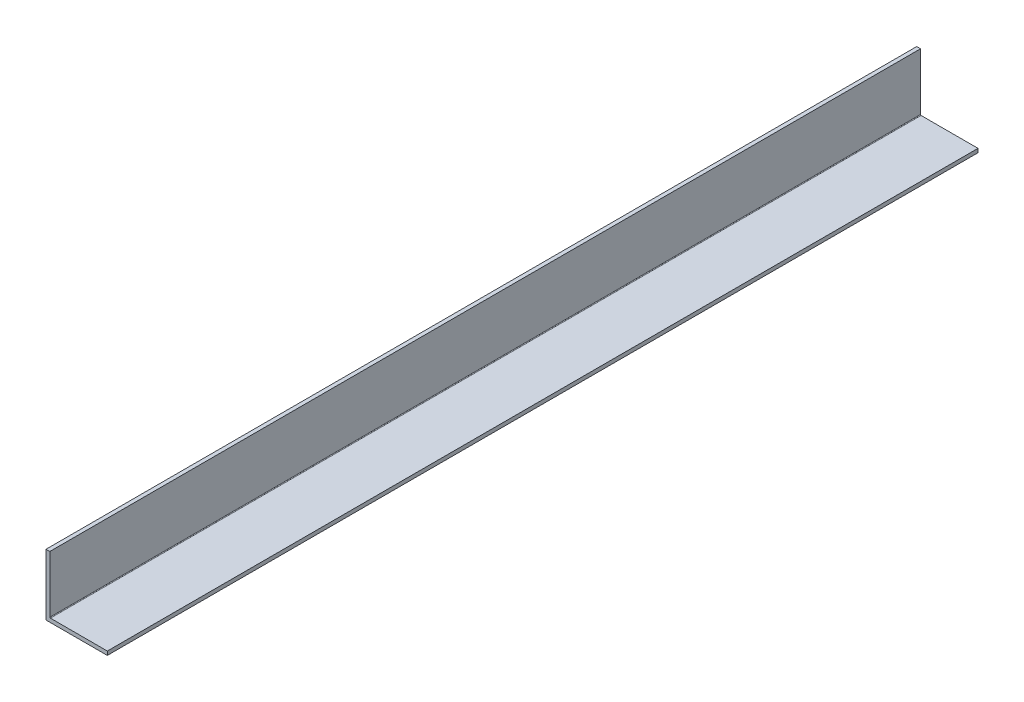
ISO-10303-21;
HEADER;
FILE_DESCRIPTION(('STEP AP214'),'2;1');
FILE_NAME('part.step','',(''),(''),'','','');
FILE_SCHEMA(('AUTOMOTIVE_DESIGN { 1 0 10303 214 1 1 1 1 }'));
ENDSEC;
DATA;
#1=APPLICATION_CONTEXT('core data for automotive mechanical design processes');
#2=APPLICATION_PROTOCOL_DEFINITION('international standard','automotive_design',2000,#1);
#3=PRODUCT_CONTEXT('',#1,'mechanical');
#4=PRODUCT('Part','Part','',(#3));
#5=PRODUCT_RELATED_PRODUCT_CATEGORY('part','',(#4));
#6=PRODUCT_DEFINITION_FORMATION('','',#4);
#7=PRODUCT_DEFINITION_CONTEXT('part definition',#1,'design');
#8=PRODUCT_DEFINITION('design','',#6,#7);
#9=PRODUCT_DEFINITION_SHAPE('','',#8);
#10=(LENGTH_UNIT() NAMED_UNIT(*) SI_UNIT(.MILLI.,.METRE.));
#11=(NAMED_UNIT(*) PLANE_ANGLE_UNIT() SI_UNIT($,.RADIAN.));
#12=(NAMED_UNIT(*) SI_UNIT($,.STERADIAN.) SOLID_ANGLE_UNIT());
#13=UNCERTAINTY_MEASURE_WITH_UNIT(LENGTH_MEASURE(1.E-05),#10,'distance_accuracy_value','');
#14=(GEOMETRIC_REPRESENTATION_CONTEXT(3) GLOBAL_UNCERTAINTY_ASSIGNED_CONTEXT((#13)) GLOBAL_UNIT_ASSIGNED_CONTEXT((#10,
#11,#12)) REPRESENTATION_CONTEXT('',''));
#15=CARTESIAN_POINT('',(0.,0.,0.));
#16=DIRECTION('',(0.,0.,1.));
#17=DIRECTION('',(1.,0.,0.));
#18=AXIS2_PLACEMENT_3D('',#15,#16,#17);
#19=CARTESIAN_POINT('',(1.5875,1.5875,304.8));
#20=DIRECTION('',(-1.,0.,0.));
#21=DIRECTION('',(0.,0.,1.));
#22=AXIS2_PLACEMENT_3D('',#19,#20,#21);
#23=PLANE('',#22);
#24=DIRECTION('',(0.,0.,-1.));
#25=VECTOR('',#24,1.);
#26=CARTESIAN_POINT('',(1.5875,1.8415,-304.8));
#27=LINE('',#26,#25);
#28=CARTESIAN_POINT('',(1.5875,1.8415,304.8));
#29=VERTEX_POINT('',#28);
#30=CARTESIAN_POINT('',(1.5875,1.8415,-55.8625));
#31=VERTEX_POINT('',#30);
#32=EDGE_CURVE('E133',#29,#31,#27,.T.);
#33=ORIENTED_EDGE('',*,*,#32,.T.);
#34=DIRECTION('',(0.,-1.,0.));
#35=VECTOR('',#34,1.);
#36=CARTESIAN_POINT('',(1.5875,25.4,-55.8625));
#37=LINE('',#36,#35);
#38=CARTESIAN_POINT('',(1.5875,25.4,-55.8625));
#39=VERTEX_POINT('',#38);
#40=EDGE_CURVE('E60',#39,#31,#37,.T.);
#41=ORIENTED_EDGE('',*,*,#40,.F.);
#42=DIRECTION('',(0.,0.,-1.));
#43=VECTOR('',#42,1.);
#44=CARTESIAN_POINT('',(1.5875,25.4,304.8));
#45=LINE('',#44,#43);
#46=CARTESIAN_POINT('',(1.5875,25.4,304.8));
#47=VERTEX_POINT('',#46);
#48=EDGE_CURVE('E122',#47,#39,#45,.T.);
#49=ORIENTED_EDGE('',*,*,#48,.F.);
#50=DIRECTION('',(0.,1.,0.));
#51=VECTOR('',#50,1.);
#52=CARTESIAN_POINT('',(1.5875,1.5875,304.8));
#53=LINE('',#52,#51);
#54=EDGE_CURVE('E124',#29,#47,#53,.T.);
#55=ORIENTED_EDGE('',*,*,#54,.F.);
#56=EDGE_LOOP('',(#33,#41,#49,#55));
#57=FACE_BOUND('',#56,.T.);
#58=ADVANCED_FACE('F44',(#57),#23,.F.);
#59=CARTESIAN_POINT('',(1.5875,25.4,304.8));
#60=DIRECTION('',(0.,-1.,0.));
#61=DIRECTION('',(0.,0.,-1.));
#62=AXIS2_PLACEMENT_3D('',#59,#60,#61);
#63=PLANE('',#62);
#64=ORIENTED_EDGE('',*,*,#48,.T.);
#65=DIRECTION('',(1.,0.,0.));
#66=VECTOR('',#65,1.);
#67=CARTESIAN_POINT('',(0.,25.4,-55.8625));
#68=LINE('',#67,#66);
#69=CARTESIAN_POINT('',(0.,25.4,-55.8625));
#70=VERTEX_POINT('',#69);
#71=EDGE_CURVE('E105',#70,#39,#68,.T.);
#72=ORIENTED_EDGE('',*,*,#71,.F.);
#73=DIRECTION('',(0.,0.,-1.));
#74=VECTOR('',#73,1.);
#75=CARTESIAN_POINT('',(0.,25.4,304.8));
#76=LINE('',#75,#74);
#77=CARTESIAN_POINT('',(0.,25.4,304.8));
#78=VERTEX_POINT('',#77);
#79=EDGE_CURVE('E119',#78,#70,#76,.T.);
#80=ORIENTED_EDGE('',*,*,#79,.F.);
#81=DIRECTION('',(-1.,0.,0.));
#82=VECTOR('',#81,1.);
#83=CARTESIAN_POINT('',(1.5875,25.4,304.8));
#84=LINE('',#83,#82);
#85=EDGE_CURVE('E160',#47,#78,#84,.T.);
#86=ORIENTED_EDGE('',*,*,#85,.F.);
#87=EDGE_LOOP('',(#64,#72,#80,#86));
#88=FACE_BOUND('',#87,.T.);
#89=ADVANCED_FACE('F117',(#88),#63,.F.);
#90=CARTESIAN_POINT('',(0.,25.4,304.8));
#91=DIRECTION('',(1.,0.,0.));
#92=DIRECTION('',(0.,1.,0.));
#93=AXIS2_PLACEMENT_3D('',#90,#91,#92);
#94=PLANE('',#93);
#95=ORIENTED_EDGE('',*,*,#79,.T.);
#96=DIRECTION('',(0.,1.,0.));
#97=VECTOR('',#96,1.);
#98=CARTESIAN_POINT('',(0.,0.,-55.8625));
#99=LINE('',#98,#97);
#100=CARTESIAN_POINT('',(0.,0.,-55.8625));
#101=VERTEX_POINT('',#100);
#102=EDGE_CURVE('E102',#101,#70,#99,.T.);
#103=ORIENTED_EDGE('',*,*,#102,.F.);
#104=DIRECTION('',(0.,0.,-1.));
#105=VECTOR('',#104,1.);
#106=CARTESIAN_POINT('',(0.,0.,304.8));
#107=LINE('',#106,#105);
#108=CARTESIAN_POINT('',(0.,0.,304.8));
#109=VERTEX_POINT('',#108);
#110=EDGE_CURVE('E129',#109,#101,#107,.T.);
#111=ORIENTED_EDGE('',*,*,#110,.F.);
#112=DIRECTION('',(0.,-1.,0.));
#113=VECTOR('',#112,1.);
#114=CARTESIAN_POINT('',(0.,25.4,304.8));
#115=LINE('',#114,#113);
#116=EDGE_CURVE('E127',#78,#109,#115,.T.);
#117=ORIENTED_EDGE('',*,*,#116,.F.);
#118=EDGE_LOOP('',(#95,#103,#111,#117));
#119=FACE_BOUND('',#118,.T.);
#120=ADVANCED_FACE('F126',(#119),#94,.F.);
#121=CARTESIAN_POINT('',(0.,0.,304.8));
#122=DIRECTION('',(0.,1.,0.));
#123=DIRECTION('',(0.,0.,1.));
#124=AXIS2_PLACEMENT_3D('',#121,#122,#123);
#125=PLANE('',#124);
#126=ORIENTED_EDGE('',*,*,#110,.T.);
#127=DIRECTION('',(-1.,0.,0.));
#128=VECTOR('',#127,1.);
#129=CARTESIAN_POINT('',(25.4,0.,-55.8625));
#130=LINE('',#129,#128);
#131=CARTESIAN_POINT('',(25.4,0.,-55.8625));
#132=VERTEX_POINT('',#131);
#133=EDGE_CURVE('E107',#132,#101,#130,.T.);
#134=ORIENTED_EDGE('',*,*,#133,.F.);
#135=DIRECTION('',(0.,0.,-1.));
#136=VECTOR('',#135,1.);
#137=CARTESIAN_POINT('',(25.4,0.,304.8));
#138=LINE('',#137,#136);
#139=CARTESIAN_POINT('',(25.4,0.,304.8));
#140=VERTEX_POINT('',#139);
#141=EDGE_CURVE('E135',#140,#132,#138,.T.);
#142=ORIENTED_EDGE('',*,*,#141,.F.);
#143=DIRECTION('',(1.,0.,0.));
#144=VECTOR('',#143,1.);
#145=CARTESIAN_POINT('',(0.,0.,304.8));
#146=LINE('',#145,#144);
#147=EDGE_CURVE('E165',#109,#140,#146,.T.);
#148=ORIENTED_EDGE('',*,*,#147,.F.);
#149=EDGE_LOOP('',(#126,#134,#142,#148));
#150=FACE_BOUND('',#149,.T.);
#151=ADVANCED_FACE('F187',(#150),#125,.F.);
#152=CARTESIAN_POINT('',(25.4,0.,304.8));
#153=DIRECTION('',(-1.,0.,0.));
#154=DIRECTION('',(0.,0.,1.));
#155=AXIS2_PLACEMENT_3D('',#152,#153,#154);
#156=PLANE('',#155);
#157=ORIENTED_EDGE('',*,*,#141,.T.);
#158=DIRECTION('',(0.,-1.,0.));
#159=VECTOR('',#158,1.);
#160=CARTESIAN_POINT('',(25.4,1.5875,-55.8625));
#161=LINE('',#160,#159);
#162=CARTESIAN_POINT('',(25.4,1.5875,-55.8625));
#163=VERTEX_POINT('',#162);
#164=EDGE_CURVE('E153',#163,#132,#161,.T.);
#165=ORIENTED_EDGE('',*,*,#164,.F.);
#166=DIRECTION('',(0.,0.,-1.));
#167=VECTOR('',#166,1.);
#168=CARTESIAN_POINT('',(25.4,1.5875,304.8));
#169=LINE('',#168,#167);
#170=CARTESIAN_POINT('',(25.4,1.5875,304.8));
#171=VERTEX_POINT('',#170);
#172=EDGE_CURVE('E174',#171,#163,#169,.T.);
#173=ORIENTED_EDGE('',*,*,#172,.F.);
#174=DIRECTION('',(0.,1.,0.));
#175=VECTOR('',#174,1.);
#176=CARTESIAN_POINT('',(25.4,0.,304.8));
#177=LINE('',#176,#175);
#178=EDGE_CURVE('E168',#140,#171,#177,.T.);
#179=ORIENTED_EDGE('',*,*,#178,.F.);
#180=EDGE_LOOP('',(#157,#165,#173,#179));
#181=FACE_BOUND('',#180,.T.);
#182=ADVANCED_FACE('F183',(#181),#156,.F.);
#183=CARTESIAN_POINT('',(25.4,1.5875,304.8));
#184=DIRECTION('',(0.,-1.,0.));
#185=DIRECTION('',(1.,0.,0.));
#186=AXIS2_PLACEMENT_3D('',#183,#184,#185);
#187=PLANE('',#186);
#188=ORIENTED_EDGE('',*,*,#172,.T.);
#189=DIRECTION('',(1.,0.,0.));
#190=VECTOR('',#189,1.);
#191=CARTESIAN_POINT('',(1.8415,1.5875,-55.8625));
#192=LINE('',#191,#190);
#193=CARTESIAN_POINT('',(1.8415,1.5875,-55.8625));
#194=VERTEX_POINT('',#193);
#195=EDGE_CURVE('E149',#194,#163,#192,.T.);
#196=ORIENTED_EDGE('',*,*,#195,.F.);
#197=DIRECTION('',(0.,0.,-1.));
#198=VECTOR('',#197,1.);
#199=CARTESIAN_POINT('',(1.8415,1.5875,304.8));
#200=LINE('',#199,#198);
#201=CARTESIAN_POINT('',(1.8415,1.5875,304.8));
#202=VERTEX_POINT('',#201);
#203=EDGE_CURVE('E53',#194,#202,#200,.F.);
#204=ORIENTED_EDGE('',*,*,#203,.T.);
#205=DIRECTION('',(-1.,0.,0.));
#206=VECTOR('',#205,1.);
#207=CARTESIAN_POINT('',(25.4,1.5875,304.8));
#208=LINE('',#207,#206);
#209=EDGE_CURVE('E171',#171,#202,#208,.T.);
#210=ORIENTED_EDGE('',*,*,#209,.F.);
#211=EDGE_LOOP('',(#188,#196,#204,#210));
#212=FACE_BOUND('',#211,.T.);
#213=ADVANCED_FACE('F191',(#212),#187,.F.);
#214=CARTESIAN_POINT('',(0.,0.,304.8));
#215=DIRECTION('',(0.,0.,1.));
#216=DIRECTION('',(1.,0.,0.));
#217=AXIS2_PLACEMENT_3D('',#214,#215,#216);
#218=PLANE('',#217);
#219=ORIENTED_EDGE('',*,*,#209,.T.);
#220=CARTESIAN_POINT('',(1.8415,1.8415,304.8));
#221=DIRECTION('',(0.,0.,1.));
#222=DIRECTION('',(1.,0.,0.));
#223=AXIS2_PLACEMENT_3D('',#220,#221,#222);
#224=CIRCLE('',#223,0.254);
#225=EDGE_CURVE('E12',#202,#29,#224,.F.);
#226=ORIENTED_EDGE('',*,*,#225,.T.);
#227=ORIENTED_EDGE('',*,*,#54,.T.);
#228=ORIENTED_EDGE('',*,*,#85,.T.);
#229=ORIENTED_EDGE('',*,*,#116,.T.);
#230=ORIENTED_EDGE('',*,*,#147,.T.);
#231=ORIENTED_EDGE('',*,*,#178,.T.);
#232=EDGE_LOOP('',(#219,#226,#227,#228,#229,#230,#231));
#233=FACE_BOUND('',#232,.T.);
#234=ADVANCED_FACE('F193',(#233),#218,.T.);
#235=CARTESIAN_POINT('',(1.8415,1.8415,304.8));
#236=DIRECTION('',(0.,0.,1.));
#237=DIRECTION('',(1.,0.,0.));
#238=AXIS2_PLACEMENT_3D('',#235,#236,#237);
#239=CYLINDRICAL_SURFACE('',#238,0.254);
#240=ORIENTED_EDGE('',*,*,#203,.F.);
#241=CARTESIAN_POINT('',(1.8415,1.8415,-55.8625));
#242=DIRECTION('',(0.,0.,1.));
#243=DIRECTION('',(1.,0.,0.));
#244=AXIS2_PLACEMENT_3D('',#241,#242,#243);
#245=CIRCLE('',#244,0.254);
#246=EDGE_CURVE('E147',#31,#194,#245,.T.);
#247=ORIENTED_EDGE('',*,*,#246,.F.);
#248=ORIENTED_EDGE('',*,*,#32,.F.);
#249=ORIENTED_EDGE('',*,*,#225,.F.);
#250=EDGE_LOOP('',(#240,#247,#248,#249));
#251=FACE_BOUND('',#250,.T.);
#252=ADVANCED_FACE('F46',(#251),#239,.F.);
#253=CARTESIAN_POINT('',(0.,0.,-55.8625));
#254=DIRECTION('',(0.,0.,1.));
#255=DIRECTION('',(1.,0.,0.));
#256=AXIS2_PLACEMENT_3D('',#253,#254,#255);
#257=PLANE('',#256);
#258=ORIENTED_EDGE('',*,*,#71,.T.);
#259=ORIENTED_EDGE('',*,*,#40,.T.);
#260=ORIENTED_EDGE('',*,*,#246,.T.);
#261=ORIENTED_EDGE('',*,*,#195,.T.);
#262=ORIENTED_EDGE('',*,*,#164,.T.);
#263=ORIENTED_EDGE('',*,*,#133,.T.);
#264=ORIENTED_EDGE('',*,*,#102,.T.);
#265=EDGE_LOOP('',(#258,#259,#260,#261,#262,#263,#264));
#266=FACE_BOUND('',#265,.T.);
#267=ADVANCED_FACE('F104',(#266),#257,.F.);
#268=CLOSED_SHELL('',(#58,#89,#120,#151,#182,#213,#234,#252,#267));
#269=MANIFOLD_SOLID_BREP('B2',#268);
#270=ADVANCED_BREP_SHAPE_REPRESENTATION('',(#18,#269),#14);
#271=SHAPE_DEFINITION_REPRESENTATION(#9,#270);
ENDSEC;
END-ISO-10303-21;
